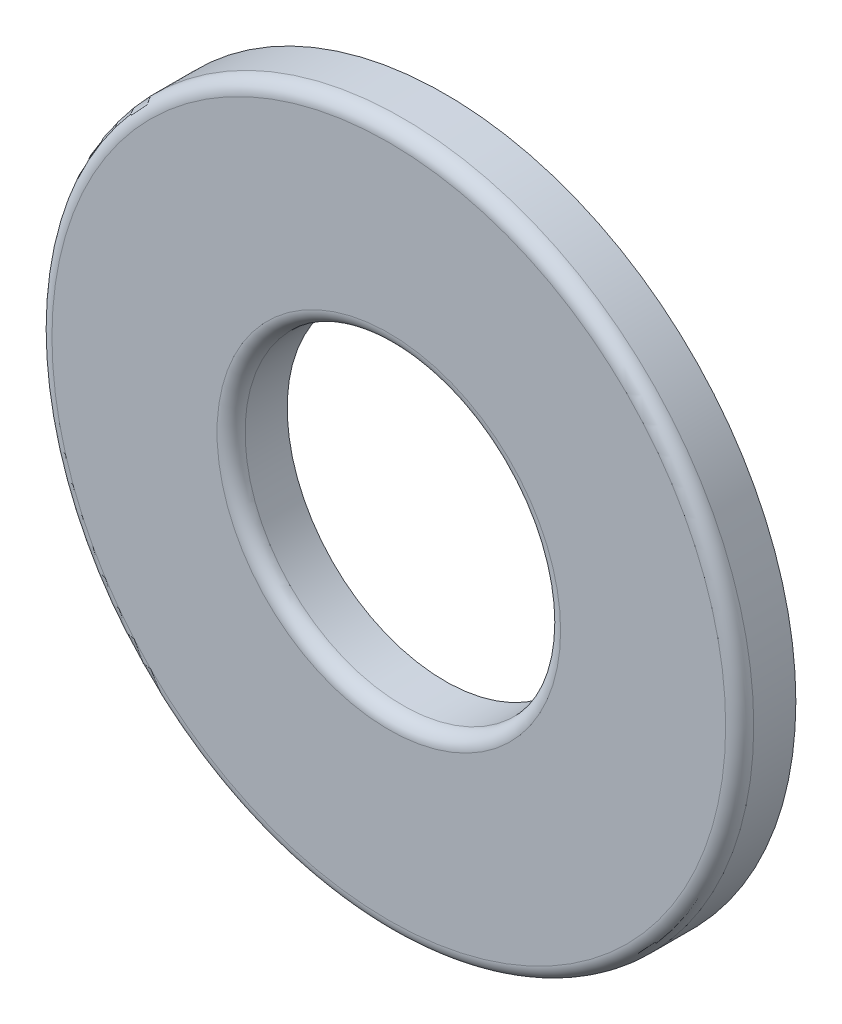
ISO-10303-21;
HEADER;
FILE_DESCRIPTION(('STEP AP214'),'2;1');
FILE_NAME('part.step','',(''),(''),'','','');
FILE_SCHEMA(('AUTOMOTIVE_DESIGN { 1 0 10303 214 1 1 1 1 }'));
ENDSEC;
DATA;
#1=APPLICATION_CONTEXT('core data for automotive mechanical design processes');
#2=APPLICATION_PROTOCOL_DEFINITION('international standard','automotive_design',2000,#1);
#3=PRODUCT_CONTEXT('',#1,'mechanical');
#4=PRODUCT('Part','Part','',(#3));
#5=PRODUCT_RELATED_PRODUCT_CATEGORY('part','',(#4));
#6=PRODUCT_DEFINITION_FORMATION('','',#4);
#7=PRODUCT_DEFINITION_CONTEXT('part definition',#1,'design');
#8=PRODUCT_DEFINITION('design','',#6,#7);
#9=PRODUCT_DEFINITION_SHAPE('','',#8);
#10=(LENGTH_UNIT() NAMED_UNIT(*) SI_UNIT(.MILLI.,.METRE.));
#11=(NAMED_UNIT(*) PLANE_ANGLE_UNIT() SI_UNIT($,.RADIAN.));
#12=(NAMED_UNIT(*) SI_UNIT($,.STERADIAN.) SOLID_ANGLE_UNIT());
#13=UNCERTAINTY_MEASURE_WITH_UNIT(LENGTH_MEASURE(1.E-05),#10,'distance_accuracy_value','');
#14=(GEOMETRIC_REPRESENTATION_CONTEXT(3) GLOBAL_UNCERTAINTY_ASSIGNED_CONTEXT((#13)) GLOBAL_UNIT_ASSIGNED_CONTEXT((#10,
#11,#12)) REPRESENTATION_CONTEXT('',''));
#15=CARTESIAN_POINT('',(0.,0.,0.));
#16=DIRECTION('',(0.,0.,1.));
#17=DIRECTION('',(1.,0.,0.));
#18=AXIS2_PLACEMENT_3D('',#15,#16,#17);
#19=CARTESIAN_POINT('',(0.,0.,0.634999999999997));
#20=DIRECTION('',(0.,0.,1.));
#21=DIRECTION('',(1.,0.,0.));
#22=AXIS2_PLACEMENT_3D('',#19,#20,#21);
#23=PLANE('',#22);
#24=CARTESIAN_POINT('',(0.,0.,0.634999999999997));
#25=DIRECTION('',(0.,0.,1.));
#26=DIRECTION('',(1.,0.,0.));
#27=AXIS2_PLACEMENT_3D('',#24,#25,#26);
#28=CIRCLE('',#27,7.62);
#29=CARTESIAN_POINT('',(7.62,0.,0.634999999999997));
#30=VERTEX_POINT('',#29);
#31=EDGE_CURVE('E44',#30,#30,#28,.T.);
#32=ORIENTED_EDGE('',*,*,#31,.T.);
#33=EDGE_LOOP('',(#32));
#34=FACE_BOUND('',#33,.T.);
#35=CARTESIAN_POINT('',(0.,0.,0.634999999999997));
#36=DIRECTION('',(0.,0.,1.));
#37=DIRECTION('',(1.,0.,0.));
#38=AXIS2_PLACEMENT_3D('',#35,#36,#37);
#39=CIRCLE('',#38,3.8862);
#40=CARTESIAN_POINT('',(3.8862,0.,0.634999999999997));
#41=VERTEX_POINT('',#40);
#42=EDGE_CURVE('E48',#41,#41,#39,.F.);
#43=ORIENTED_EDGE('',*,*,#42,.T.);
#44=EDGE_LOOP('',(#43));
#45=FACE_BOUND('',#44,.T.);
#46=ADVANCED_FACE('F33',(#34,#45),#23,.T.);
#47=CARTESIAN_POINT('',(0.,0.,0.634999999999997));
#48=DIRECTION('',(0.,0.,-1.));
#49=DIRECTION('',(-1.,0.,0.));
#50=AXIS2_PLACEMENT_3D('',#47,#48,#49);
#51=CYLINDRICAL_SURFACE('',#50,7.9375);
#52=CARTESIAN_POINT('',(0.,0.,0.317499999999997));
#53=DIRECTION('',(0.,0.,1.));
#54=DIRECTION('',(1.,0.,0.));
#55=AXIS2_PLACEMENT_3D('',#52,#53,#54);
#56=CIRCLE('',#55,7.9375);
#57=CARTESIAN_POINT('',(7.9375,0.,0.317499999999997));
#58=VERTEX_POINT('',#57);
#59=EDGE_CURVE('E40',#58,#58,#56,.F.);
#60=ORIENTED_EDGE('',*,*,#59,.T.);
#61=EDGE_LOOP('',(#60));
#62=FACE_BOUND('',#61,.T.);
#63=CARTESIAN_POINT('',(0.,0.,-0.635000000000003));
#64=DIRECTION('',(0.,0.,1.));
#65=DIRECTION('',(1.,0.,0.));
#66=AXIS2_PLACEMENT_3D('',#63,#64,#65);
#67=CIRCLE('',#66,7.9375);
#68=CARTESIAN_POINT('',(7.9375,0.,-0.635000000000003));
#69=VERTEX_POINT('',#68);
#70=EDGE_CURVE('E53',#69,#69,#67,.T.);
#71=ORIENTED_EDGE('',*,*,#70,.T.);
#72=EDGE_LOOP('',(#71));
#73=FACE_BOUND('',#72,.T.);
#74=ADVANCED_FACE('F65',(#62,#73),#51,.T.);
#75=CARTESIAN_POINT('',(0.,0.,0.634999999999997));
#76=DIRECTION('',(0.,0.,-1.));
#77=DIRECTION('',(-1.,0.,0.));
#78=AXIS2_PLACEMENT_3D('',#75,#76,#77);
#79=CYLINDRICAL_SURFACE('',#78,3.5687);
#80=CARTESIAN_POINT('',(0.,0.,0.317499999999997));
#81=DIRECTION('',(0.,0.,1.));
#82=DIRECTION('',(1.,0.,0.));
#83=AXIS2_PLACEMENT_3D('',#80,#81,#82);
#84=CIRCLE('',#83,3.5687);
#85=CARTESIAN_POINT('',(3.5687,0.,0.317499999999997));
#86=VERTEX_POINT('',#85);
#87=EDGE_CURVE('E10',#86,#86,#84,.T.);
#88=ORIENTED_EDGE('',*,*,#87,.T.);
#89=EDGE_LOOP('',(#88));
#90=FACE_BOUND('',#89,.T.);
#91=CARTESIAN_POINT('',(0.,0.,-0.635000000000003));
#92=DIRECTION('',(0.,0.,1.));
#93=DIRECTION('',(1.,0.,0.));
#94=AXIS2_PLACEMENT_3D('',#91,#92,#93);
#95=CIRCLE('',#94,3.5687);
#96=CARTESIAN_POINT('',(3.5687,0.,-0.635000000000003));
#97=VERTEX_POINT('',#96);
#98=EDGE_CURVE('E56',#97,#97,#95,.T.);
#99=ORIENTED_EDGE('',*,*,#98,.F.);
#100=EDGE_LOOP('',(#99));
#101=FACE_BOUND('',#100,.T.);
#102=ADVANCED_FACE('F63',(#90,#101),#79,.F.);
#103=CARTESIAN_POINT('',(0.,0.,-0.635000000000003));
#104=DIRECTION('',(0.,0.,1.));
#105=DIRECTION('',(1.,0.,0.));
#106=AXIS2_PLACEMENT_3D('',#103,#104,#105);
#107=PLANE('',#106);
#108=ORIENTED_EDGE('',*,*,#98,.T.);
#109=EDGE_LOOP('',(#108));
#110=FACE_BOUND('',#109,.T.);
#111=ORIENTED_EDGE('',*,*,#70,.F.);
#112=EDGE_LOOP('',(#111));
#113=FACE_BOUND('',#112,.T.);
#114=ADVANCED_FACE('F60',(#110,#113),#107,.F.);
#115=CARTESIAN_POINT('',(0.,0.,0.317499999999997));
#116=DIRECTION('',(0.,0.,1.));
#117=DIRECTION('',(1.,0.,0.));
#118=AXIS2_PLACEMENT_3D('',#115,#116,#117);
#119=TOROIDAL_SURFACE('',#118,7.62,0.3175);
#120=ORIENTED_EDGE('',*,*,#59,.F.);
#121=EDGE_LOOP('',(#120));
#122=FACE_BOUND('',#121,.T.);
#123=ORIENTED_EDGE('',*,*,#31,.F.);
#124=EDGE_LOOP('',(#123));
#125=FACE_BOUND('',#124,.T.);
#126=ADVANCED_FACE('F71',(#122,#125),#119,.T.);
#127=CARTESIAN_POINT('',(0.,0.,0.317499999999997));
#128=DIRECTION('',(0.,0.,1.));
#129=DIRECTION('',(1.,0.,0.));
#130=AXIS2_PLACEMENT_3D('',#127,#128,#129);
#131=TOROIDAL_SURFACE('',#130,3.8862,0.3175);
#132=ORIENTED_EDGE('',*,*,#42,.F.);
#133=EDGE_LOOP('',(#132));
#134=FACE_BOUND('',#133,.T.);
#135=ORIENTED_EDGE('',*,*,#87,.F.);
#136=EDGE_LOOP('',(#135));
#137=FACE_BOUND('',#136,.T.);
#138=ADVANCED_FACE('F35',(#134,#137),#131,.T.);
#139=CLOSED_SHELL('',(#46,#74,#102,#114,#126,#138));
#140=MANIFOLD_SOLID_BREP('B2',#139);
#141=ADVANCED_BREP_SHAPE_REPRESENTATION('',(#18,#140),#14);
#142=SHAPE_DEFINITION_REPRESENTATION(#9,#141);
ENDSEC;
END-ISO-10303-21;
